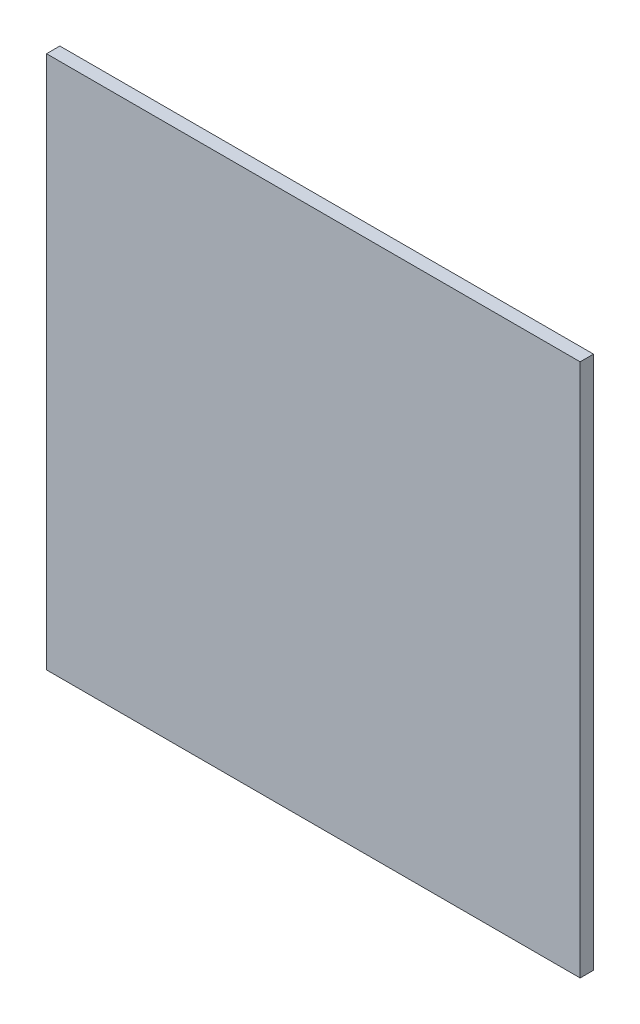
ISO-10303-21;
HEADER;
FILE_DESCRIPTION(('STEP AP214'),'2;1');
FILE_NAME('part.step','',(''),(''),'','','');
FILE_SCHEMA(('AUTOMOTIVE_DESIGN { 1 0 10303 214 1 1 1 1 }'));
ENDSEC;
DATA;
#1=APPLICATION_CONTEXT('core data for automotive mechanical design processes');
#2=APPLICATION_PROTOCOL_DEFINITION('international standard','automotive_design',2000,#1);
#3=PRODUCT_CONTEXT('',#1,'mechanical');
#4=PRODUCT('Part','Part','',(#3));
#5=PRODUCT_RELATED_PRODUCT_CATEGORY('part','',(#4));
#6=PRODUCT_DEFINITION_FORMATION('','',#4);
#7=PRODUCT_DEFINITION_CONTEXT('part definition',#1,'design');
#8=PRODUCT_DEFINITION('design','',#6,#7);
#9=PRODUCT_DEFINITION_SHAPE('','',#8);
#10=(LENGTH_UNIT() NAMED_UNIT(*) SI_UNIT(.MILLI.,.METRE.));
#11=(NAMED_UNIT(*) PLANE_ANGLE_UNIT() SI_UNIT($,.RADIAN.));
#12=(NAMED_UNIT(*) SI_UNIT($,.STERADIAN.) SOLID_ANGLE_UNIT());
#13=UNCERTAINTY_MEASURE_WITH_UNIT(LENGTH_MEASURE(1.E-05),#10,'distance_accuracy_value','');
#14=(GEOMETRIC_REPRESENTATION_CONTEXT(3) GLOBAL_UNCERTAINTY_ASSIGNED_CONTEXT((#13)) GLOBAL_UNIT_ASSIGNED_CONTEXT((#10,
#11,#12)) REPRESENTATION_CONTEXT('',''));
#15=CARTESIAN_POINT('',(0.,0.,0.));
#16=DIRECTION('',(0.,0.,1.));
#17=DIRECTION('',(1.,0.,0.));
#18=AXIS2_PLACEMENT_3D('',#15,#16,#17);
#19=CARTESIAN_POINT('',(-281.841613288941,84.858409110609,10.));
#20=DIRECTION('',(1.,0.,0.));
#21=DIRECTION('',(0.,0.,-1.));
#22=AXIS2_PLACEMENT_3D('',#19,#20,#21);
#23=PLANE('',#22);
#24=DIRECTION('',(0.,-1.,0.));
#25=VECTOR('',#24,1.);
#26=CARTESIAN_POINT('',(-281.841613288941,84.858409110609,0.));
#27=LINE('',#26,#25);
#28=CARTESIAN_POINT('',(-281.841613288941,84.858409110609,0.));
#29=VERTEX_POINT('',#28);
#30=CARTESIAN_POINT('',(-281.841613288941,-315.141590889391,0.));
#31=VERTEX_POINT('',#30);
#32=EDGE_CURVE('E93',#29,#31,#27,.T.);
#33=ORIENTED_EDGE('',*,*,#32,.T.);
#34=DIRECTION('',(0.,0.,-1.));
#35=VECTOR('',#34,1.);
#36=CARTESIAN_POINT('',(-281.841613288941,-315.141590889391,10.));
#37=LINE('',#36,#35);
#38=CARTESIAN_POINT('',(-281.841613288941,-315.141590889391,10.));
#39=VERTEX_POINT('',#38);
#40=EDGE_CURVE('E11',#39,#31,#37,.T.);
#41=ORIENTED_EDGE('',*,*,#40,.F.);
#42=DIRECTION('',(0.,-1.,0.));
#43=VECTOR('',#42,1.);
#44=CARTESIAN_POINT('',(-281.841613288941,84.858409110609,10.));
#45=LINE('',#44,#43);
#46=CARTESIAN_POINT('',(-281.841613288941,84.858409110609,10.));
#47=VERTEX_POINT('',#46);
#48=EDGE_CURVE('E81',#47,#39,#45,.T.);
#49=ORIENTED_EDGE('',*,*,#48,.F.);
#50=DIRECTION('',(0.,0.,-1.));
#51=VECTOR('',#50,1.);
#52=CARTESIAN_POINT('',(-281.841613288941,84.858409110609,10.));
#53=LINE('',#52,#51);
#54=EDGE_CURVE('E89',#47,#29,#53,.T.);
#55=ORIENTED_EDGE('',*,*,#54,.T.);
#56=EDGE_LOOP('',(#33,#41,#49,#55));
#57=FACE_BOUND('',#56,.T.);
#58=ADVANCED_FACE('F30',(#57),#23,.F.);
#59=CARTESIAN_POINT('',(118.158386711059,-315.141590889391,10.));
#60=DIRECTION('',(0.,1.,0.));
#61=DIRECTION('',(-1.,0.,0.));
#62=AXIS2_PLACEMENT_3D('',#59,#60,#61);
#63=PLANE('',#62);
#64=DIRECTION('',(1.,0.,0.));
#65=VECTOR('',#64,1.);
#66=CARTESIAN_POINT('',(118.158386711059,-315.141590889391,0.));
#67=LINE('',#66,#65);
#68=CARTESIAN_POINT('',(118.158386711059,-315.141590889391,0.));
#69=VERTEX_POINT('',#68);
#70=EDGE_CURVE('E85',#31,#69,#67,.T.);
#71=ORIENTED_EDGE('',*,*,#70,.T.);
#72=DIRECTION('',(0.,0.,-1.));
#73=VECTOR('',#72,1.);
#74=CARTESIAN_POINT('',(118.158386711059,-315.141590889391,10.));
#75=LINE('',#74,#73);
#76=CARTESIAN_POINT('',(118.158386711059,-315.141590889391,10.));
#77=VERTEX_POINT('',#76);
#78=EDGE_CURVE('E38',#77,#69,#75,.T.);
#79=ORIENTED_EDGE('',*,*,#78,.F.);
#80=DIRECTION('',(1.,0.,0.));
#81=VECTOR('',#80,1.);
#82=CARTESIAN_POINT('',(118.158386711059,-315.141590889391,10.));
#83=LINE('',#82,#81);
#84=EDGE_CURVE('E76',#39,#77,#83,.T.);
#85=ORIENTED_EDGE('',*,*,#84,.F.);
#86=ORIENTED_EDGE('',*,*,#40,.T.);
#87=EDGE_LOOP('',(#71,#79,#85,#86));
#88=FACE_BOUND('',#87,.T.);
#89=ADVANCED_FACE('F84',(#88),#63,.F.);
#90=CARTESIAN_POINT('',(118.158386711059,84.858409110609,10.));
#91=DIRECTION('',(-1.,0.,0.));
#92=DIRECTION('',(0.,-1.,0.));
#93=AXIS2_PLACEMENT_3D('',#90,#91,#92);
#94=PLANE('',#93);
#95=DIRECTION('',(0.,1.,0.));
#96=VECTOR('',#95,1.);
#97=CARTESIAN_POINT('',(118.158386711059,84.858409110609,0.));
#98=LINE('',#97,#96);
#99=CARTESIAN_POINT('',(118.158386711059,84.858409110609,0.));
#100=VERTEX_POINT('',#99);
#101=EDGE_CURVE('E63',#69,#100,#98,.T.);
#102=ORIENTED_EDGE('',*,*,#101,.T.);
#103=DIRECTION('',(0.,0.,-1.));
#104=VECTOR('',#103,1.);
#105=CARTESIAN_POINT('',(118.158386711059,84.858409110609,10.));
#106=LINE('',#105,#104);
#107=CARTESIAN_POINT('',(118.158386711059,84.858409110609,10.));
#108=VERTEX_POINT('',#107);
#109=EDGE_CURVE('E86',#108,#100,#106,.T.);
#110=ORIENTED_EDGE('',*,*,#109,.F.);
#111=DIRECTION('',(0.,1.,0.));
#112=VECTOR('',#111,1.);
#113=CARTESIAN_POINT('',(118.158386711059,84.858409110609,10.));
#114=LINE('',#113,#112);
#115=EDGE_CURVE('E79',#77,#108,#114,.T.);
#116=ORIENTED_EDGE('',*,*,#115,.F.);
#117=ORIENTED_EDGE('',*,*,#78,.T.);
#118=EDGE_LOOP('',(#102,#110,#116,#117));
#119=FACE_BOUND('',#118,.T.);
#120=ADVANCED_FACE('F87',(#119),#94,.F.);
#121=CARTESIAN_POINT('',(118.158386711059,84.858409110609,10.));
#122=DIRECTION('',(0.,-1.,0.));
#123=DIRECTION('',(1.,0.,0.));
#124=AXIS2_PLACEMENT_3D('',#121,#122,#123);
#125=PLANE('',#124);
#126=DIRECTION('',(-1.,0.,0.));
#127=VECTOR('',#126,1.);
#128=CARTESIAN_POINT('',(118.158386711059,84.858409110609,0.));
#129=LINE('',#128,#127);
#130=EDGE_CURVE('E69',#100,#29,#129,.T.);
#131=ORIENTED_EDGE('',*,*,#130,.T.);
#132=ORIENTED_EDGE('',*,*,#54,.F.);
#133=DIRECTION('',(-1.,0.,0.));
#134=VECTOR('',#133,1.);
#135=CARTESIAN_POINT('',(118.158386711059,84.858409110609,10.));
#136=LINE('',#135,#134);
#137=EDGE_CURVE('E46',#108,#47,#136,.T.);
#138=ORIENTED_EDGE('',*,*,#137,.F.);
#139=ORIENTED_EDGE('',*,*,#109,.T.);
#140=EDGE_LOOP('',(#131,#132,#138,#139));
#141=FACE_BOUND('',#140,.T.);
#142=ADVANCED_FACE('F100',(#141),#125,.F.);
#143=CARTESIAN_POINT('',(-281.841613288941,-315.141590889391,10.));
#144=DIRECTION('',(0.,0.,-1.));
#145=DIRECTION('',(-1.,0.,0.));
#146=AXIS2_PLACEMENT_3D('',#143,#144,#145);
#147=PLANE('',#146);
#148=ORIENTED_EDGE('',*,*,#48,.T.);
#149=ORIENTED_EDGE('',*,*,#84,.T.);
#150=ORIENTED_EDGE('',*,*,#115,.T.);
#151=ORIENTED_EDGE('',*,*,#137,.T.);
#152=EDGE_LOOP('',(#148,#149,#150,#151));
#153=FACE_BOUND('',#152,.T.);
#154=ADVANCED_FACE('F77',(#153),#147,.F.);
#155=CARTESIAN_POINT('',(-281.841613288941,-315.141590889391,0.));
#156=DIRECTION('',(0.,0.,-1.));
#157=DIRECTION('',(-1.,0.,0.));
#158=AXIS2_PLACEMENT_3D('',#155,#156,#157);
#159=PLANE('',#158);
#160=ORIENTED_EDGE('',*,*,#32,.F.);
#161=ORIENTED_EDGE('',*,*,#130,.F.);
#162=ORIENTED_EDGE('',*,*,#101,.F.);
#163=ORIENTED_EDGE('',*,*,#70,.F.);
#164=EDGE_LOOP('',(#160,#161,#162,#163));
#165=FACE_BOUND('',#164,.T.);
#166=ADVANCED_FACE('F103',(#165),#159,.T.);
#167=CLOSED_SHELL('',(#58,#89,#120,#142,#154,#166));
#168=MANIFOLD_SOLID_BREP('B2',#167);
#169=ADVANCED_BREP_SHAPE_REPRESENTATION('',(#18,#168),#14);
#170=SHAPE_DEFINITION_REPRESENTATION(#9,#169);
ENDSEC;
END-ISO-10303-21;
